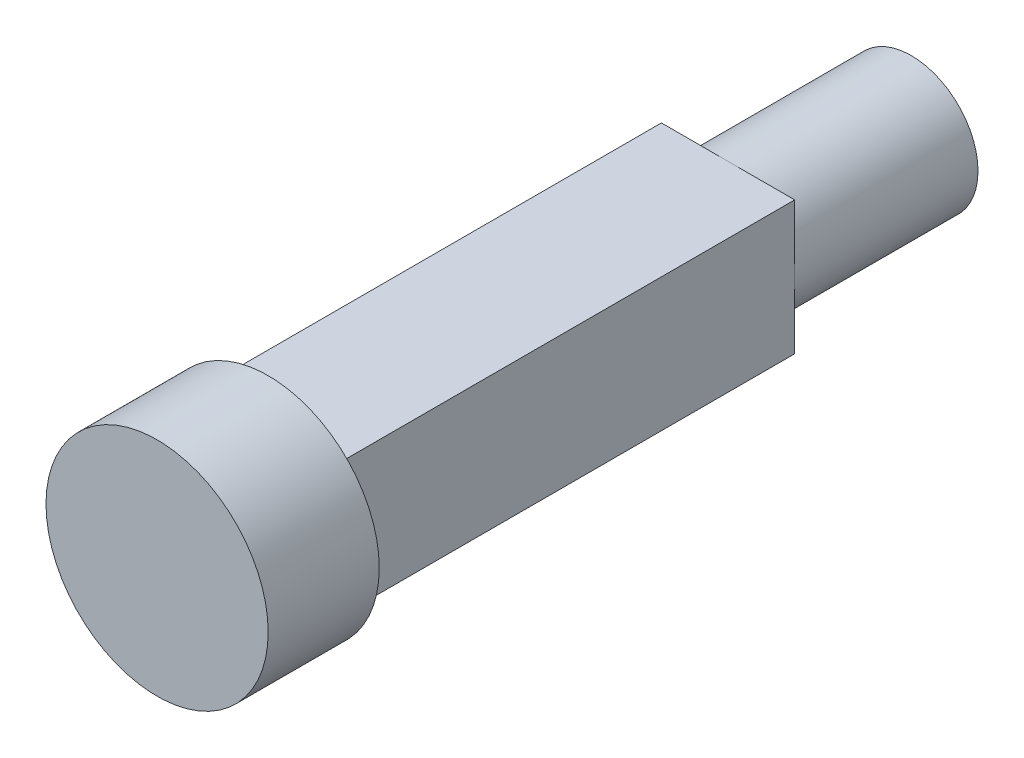
ISO-10303-21;
HEADER;
FILE_DESCRIPTION(('STEP AP214'),'2;1');
FILE_NAME('part.step','',(''),(''),'','','');
FILE_SCHEMA(('AUTOMOTIVE_DESIGN { 1 0 10303 214 1 1 1 1 }'));
ENDSEC;
DATA;
#1=APPLICATION_CONTEXT('core data for automotive mechanical design processes');
#2=APPLICATION_PROTOCOL_DEFINITION('international standard','automotive_design',2000,#1);
#3=PRODUCT_CONTEXT('',#1,'mechanical');
#4=PRODUCT('Part','Part','',(#3));
#5=PRODUCT_RELATED_PRODUCT_CATEGORY('part','',(#4));
#6=PRODUCT_DEFINITION_FORMATION('','',#4);
#7=PRODUCT_DEFINITION_CONTEXT('part definition',#1,'design');
#8=PRODUCT_DEFINITION('design','',#6,#7);
#9=PRODUCT_DEFINITION_SHAPE('','',#8);
#10=(LENGTH_UNIT() NAMED_UNIT(*) SI_UNIT(.MILLI.,.METRE.));
#11=(NAMED_UNIT(*) PLANE_ANGLE_UNIT() SI_UNIT($,.RADIAN.));
#12=(NAMED_UNIT(*) SI_UNIT($,.STERADIAN.) SOLID_ANGLE_UNIT());
#13=UNCERTAINTY_MEASURE_WITH_UNIT(LENGTH_MEASURE(1.E-05),#10,'distance_accuracy_value','');
#14=(GEOMETRIC_REPRESENTATION_CONTEXT(3) GLOBAL_UNCERTAINTY_ASSIGNED_CONTEXT((#13)) GLOBAL_UNIT_ASSIGNED_CONTEXT((#10,
#11,#12)) REPRESENTATION_CONTEXT('',''));
#15=CARTESIAN_POINT('',(0.,0.,0.));
#16=DIRECTION('',(0.,0.,1.));
#17=DIRECTION('',(1.,0.,0.));
#18=AXIS2_PLACEMENT_3D('',#15,#16,#17);
#19=CARTESIAN_POINT('',(0.,3.,-5.));
#20=DIRECTION('',(0.,0.,1.));
#21=DIRECTION('',(1.,0.,0.));
#22=AXIS2_PLACEMENT_3D('',#19,#20,#21);
#23=PLANE('',#22);
#24=CARTESIAN_POINT('',(0.,0.,-5.));
#25=DIRECTION('',(0.,0.,1.));
#26=DIRECTION('',(1.,0.,0.));
#27=AXIS2_PLACEMENT_3D('',#24,#25,#26);
#28=CIRCLE('',#27,5.);
#29=CARTESIAN_POINT('',(5.,0.,-5.));
#30=VERTEX_POINT('',#29);
#31=EDGE_CURVE('E170',#30,#30,#28,.T.);
#32=ORIENTED_EDGE('',*,*,#31,.F.);
#33=EDGE_LOOP('',(#32));
#34=FACE_BOUND('',#33,.T.);
#35=DIRECTION('',(0.,1.,0.));
#36=VECTOR('',#35,1.);
#37=CARTESIAN_POINT('',(-3.,3.,-5.));
#38=LINE('',#37,#36);
#39=CARTESIAN_POINT('',(-3.,-3.,-5.));
#40=VERTEX_POINT('',#39);
#41=CARTESIAN_POINT('',(-3.,3.,-5.));
#42=VERTEX_POINT('',#41);
#43=EDGE_CURVE('E189',#40,#42,#38,.T.);
#44=ORIENTED_EDGE('',*,*,#43,.F.);
#45=DIRECTION('',(-1.,0.,0.));
#46=VECTOR('',#45,1.);
#47=CARTESIAN_POINT('',(0.,-3.,-5.));
#48=LINE('',#47,#46);
#49=CARTESIAN_POINT('',(3.,-3.,-5.));
#50=VERTEX_POINT('',#49);
#51=EDGE_CURVE('E178',#50,#40,#48,.T.);
#52=ORIENTED_EDGE('',*,*,#51,.F.);
#53=DIRECTION('',(0.,-1.,0.));
#54=VECTOR('',#53,1.);
#55=CARTESIAN_POINT('',(3.,3.,-5.));
#56=LINE('',#55,#54);
#57=CARTESIAN_POINT('',(3.,3.,-5.));
#58=VERTEX_POINT('',#57);
#59=EDGE_CURVE('E182',#58,#50,#56,.T.);
#60=ORIENTED_EDGE('',*,*,#59,.F.);
#61=DIRECTION('',(1.,0.,0.));
#62=VECTOR('',#61,1.);
#63=CARTESIAN_POINT('',(0.,3.,-5.));
#64=LINE('',#63,#62);
#65=EDGE_CURVE('E186',#42,#58,#64,.T.);
#66=ORIENTED_EDGE('',*,*,#65,.F.);
#67=EDGE_LOOP('',(#44,#52,#60,#66));
#68=FACE_BOUND('',#67,.T.);
#69=ADVANCED_FACE('F39',(#34,#68),#23,.F.);
#70=CARTESIAN_POINT('',(0.,4.99999999999999,0.));
#71=DIRECTION('',(0.,0.,-1.));
#72=DIRECTION('',(-1.,0.,0.));
#73=AXIS2_PLACEMENT_3D('',#70,#71,#72);
#74=PLANE('',#73);
#75=CARTESIAN_POINT('',(0.,0.,0.));
#76=DIRECTION('',(0.,0.,1.));
#77=DIRECTION('',(1.,0.,0.));
#78=AXIS2_PLACEMENT_3D('',#75,#76,#77);
#79=CIRCLE('',#78,4.99999999999999);
#80=CARTESIAN_POINT('',(4.99999999999999,0.,0.));
#81=VERTEX_POINT('',#80);
#82=EDGE_CURVE('E166',#81,#81,#79,.T.);
#83=ORIENTED_EDGE('',*,*,#82,.T.);
#84=EDGE_LOOP('',(#83));
#85=FACE_BOUND('',#84,.T.);
#86=ADVANCED_FACE('F41',(#85),#74,.F.);
#87=CARTESIAN_POINT('',(0.,0.,0.));
#88=DIRECTION('',(0.,0.,1.));
#89=DIRECTION('',(1.,0.,0.));
#90=AXIS2_PLACEMENT_3D('',#87,#88,#89);
#91=CYLINDRICAL_SURFACE('',#90,5.);
#92=ORIENTED_EDGE('',*,*,#82,.F.);
#93=EDGE_LOOP('',(#92));
#94=FACE_BOUND('',#93,.T.);
#95=ORIENTED_EDGE('',*,*,#31,.T.);
#96=EDGE_LOOP('',(#95));
#97=FACE_BOUND('',#96,.T.);
#98=ADVANCED_FACE('F248',(#94,#97),#91,.T.);
#99=CARTESIAN_POINT('',(0.,0.,-25.7));
#100=DIRECTION('',(0.,0.,1.));
#101=DIRECTION('',(1.,0.,0.));
#102=AXIS2_PLACEMENT_3D('',#99,#100,#101);
#103=PLANE('',#102);
#104=DIRECTION('',(0.,-1.,0.));
#105=VECTOR('',#104,1.);
#106=CARTESIAN_POINT('',(3.,-3.,-25.7));
#107=LINE('',#106,#105);
#108=CARTESIAN_POINT('',(3.,3.,-25.7));
#109=VERTEX_POINT('',#108);
#110=CARTESIAN_POINT('',(3.,0.,-25.7));
#111=VERTEX_POINT('',#110);
#112=EDGE_CURVE('E141',#109,#111,#107,.T.);
#113=ORIENTED_EDGE('',*,*,#112,.T.);
#114=CARTESIAN_POINT('',(0.,0.,-25.7));
#115=DIRECTION('',(0.,0.,1.));
#116=DIRECTION('',(1.,0.,0.));
#117=AXIS2_PLACEMENT_3D('',#114,#115,#116);
#118=CIRCLE('',#117,3.);
#119=CARTESIAN_POINT('',(0.,3.,-25.7));
#120=VERTEX_POINT('',#119);
#121=EDGE_CURVE('E11',#111,#120,#118,.T.);
#122=ORIENTED_EDGE('',*,*,#121,.T.);
#123=DIRECTION('',(1.,0.,0.));
#124=VECTOR('',#123,1.);
#125=CARTESIAN_POINT('',(3.,3.,-25.7));
#126=LINE('',#125,#124);
#127=EDGE_CURVE('E135',#120,#109,#126,.T.);
#128=ORIENTED_EDGE('',*,*,#127,.T.);
#129=EDGE_LOOP('',(#113,#122,#128));
#130=FACE_BOUND('',#129,.T.);
#131=ADVANCED_FACE('F230',(#130),#103,.F.);
#132=CARTESIAN_POINT('',(-3.,3.,-25.7));
#133=VERTEX_POINT('',#132);
#134=EDGE_CURVE('E136',#133,#120,#126,.T.);
#135=ORIENTED_EDGE('',*,*,#134,.T.);
#136=CARTESIAN_POINT('',(-3.,0.,-25.7));
#137=VERTEX_POINT('',#136);
#138=EDGE_CURVE('E49',#120,#137,#118,.T.);
#139=ORIENTED_EDGE('',*,*,#138,.T.);
#140=DIRECTION('',(0.,1.,0.));
#141=VECTOR('',#140,1.);
#142=CARTESIAN_POINT('',(-3.,-3.,-25.7));
#143=LINE('',#142,#141);
#144=EDGE_CURVE('E129',#137,#133,#143,.T.);
#145=ORIENTED_EDGE('',*,*,#144,.T.);
#146=EDGE_LOOP('',(#135,#139,#145));
#147=FACE_BOUND('',#146,.T.);
#148=ADVANCED_FACE('F206',(#147),#103,.F.);
#149=CARTESIAN_POINT('',(-3.,-3.,-25.7));
#150=VERTEX_POINT('',#149);
#151=EDGE_CURVE('E131',#150,#137,#143,.T.);
#152=ORIENTED_EDGE('',*,*,#151,.T.);
#153=CARTESIAN_POINT('',(0.,-3.,-25.7));
#154=VERTEX_POINT('',#153);
#155=EDGE_CURVE('E196',#137,#154,#118,.T.);
#156=ORIENTED_EDGE('',*,*,#155,.T.);
#157=DIRECTION('',(-1.,0.,0.));
#158=VECTOR('',#157,1.);
#159=CARTESIAN_POINT('',(3.,-3.,-25.7));
#160=LINE('',#159,#158);
#161=EDGE_CURVE('E145',#154,#150,#160,.T.);
#162=ORIENTED_EDGE('',*,*,#161,.T.);
#163=EDGE_LOOP('',(#152,#156,#162));
#164=FACE_BOUND('',#163,.T.);
#165=ADVANCED_FACE('F211',(#164),#103,.F.);
#166=CARTESIAN_POINT('',(-3.,-3.,-25.7));
#167=DIRECTION('',(1.,0.,0.));
#168=DIRECTION('',(0.,0.,-1.));
#169=AXIS2_PLACEMENT_3D('',#166,#167,#168);
#170=PLANE('',#169);
#171=ORIENTED_EDGE('',*,*,#144,.F.);
#172=ORIENTED_EDGE('',*,*,#151,.F.);
#173=DIRECTION('',(0.,0.,1.));
#174=VECTOR('',#173,1.);
#175=CARTESIAN_POINT('',(-3.,-3.,-25.7));
#176=LINE('',#175,#174);
#177=EDGE_CURVE('E150',#150,#40,#176,.T.);
#178=ORIENTED_EDGE('',*,*,#177,.T.);
#179=ORIENTED_EDGE('',*,*,#43,.T.);
#180=DIRECTION('',(0.,0.,1.));
#181=VECTOR('',#180,1.);
#182=CARTESIAN_POINT('',(-3.,3.,-25.7));
#183=LINE('',#182,#181);
#184=EDGE_CURVE('E162',#133,#42,#183,.T.);
#185=ORIENTED_EDGE('',*,*,#184,.F.);
#186=EDGE_LOOP('',(#171,#172,#178,#179,#185));
#187=FACE_BOUND('',#186,.T.);
#188=ADVANCED_FACE('F209',(#187),#170,.F.);
#189=CARTESIAN_POINT('',(3.,3.,-25.7));
#190=DIRECTION('',(0.,-1.,0.));
#191=DIRECTION('',(0.,0.,-1.));
#192=AXIS2_PLACEMENT_3D('',#189,#190,#191);
#193=PLANE('',#192);
#194=ORIENTED_EDGE('',*,*,#127,.F.);
#195=ORIENTED_EDGE('',*,*,#134,.F.);
#196=ORIENTED_EDGE('',*,*,#184,.T.);
#197=ORIENTED_EDGE('',*,*,#65,.T.);
#198=DIRECTION('',(0.,0.,1.));
#199=VECTOR('',#198,1.);
#200=CARTESIAN_POINT('',(3.,3.,-25.7));
#201=LINE('',#200,#199);
#202=EDGE_CURVE('E158',#109,#58,#201,.T.);
#203=ORIENTED_EDGE('',*,*,#202,.F.);
#204=EDGE_LOOP('',(#194,#195,#196,#197,#203));
#205=FACE_BOUND('',#204,.T.);
#206=ADVANCED_FACE('F225',(#205),#193,.F.);
#207=CARTESIAN_POINT('',(3.,-3.,-25.7));
#208=DIRECTION('',(-1.,0.,0.));
#209=DIRECTION('',(0.,0.,1.));
#210=AXIS2_PLACEMENT_3D('',#207,#208,#209);
#211=PLANE('',#210);
#212=CARTESIAN_POINT('',(3.,-3.,-25.7));
#213=VERTEX_POINT('',#212);
#214=EDGE_CURVE('E140',#111,#213,#107,.T.);
#215=ORIENTED_EDGE('',*,*,#214,.F.);
#216=ORIENTED_EDGE('',*,*,#112,.F.);
#217=ORIENTED_EDGE('',*,*,#202,.T.);
#218=ORIENTED_EDGE('',*,*,#59,.T.);
#219=DIRECTION('',(0.,0.,1.));
#220=VECTOR('',#219,1.);
#221=CARTESIAN_POINT('',(3.,-3.,-25.7));
#222=LINE('',#221,#220);
#223=EDGE_CURVE('E154',#213,#50,#222,.T.);
#224=ORIENTED_EDGE('',*,*,#223,.F.);
#225=EDGE_LOOP('',(#215,#216,#217,#218,#224));
#226=FACE_BOUND('',#225,.T.);
#227=ADVANCED_FACE('F220',(#226),#211,.F.);
#228=CARTESIAN_POINT('',(3.,-3.,-25.7));
#229=DIRECTION('',(0.,1.,0.));
#230=DIRECTION('',(0.,0.,1.));
#231=AXIS2_PLACEMENT_3D('',#228,#229,#230);
#232=PLANE('',#231);
#233=ORIENTED_EDGE('',*,*,#161,.F.);
#234=EDGE_CURVE('E146',#213,#154,#160,.T.);
#235=ORIENTED_EDGE('',*,*,#234,.F.);
#236=ORIENTED_EDGE('',*,*,#223,.T.);
#237=ORIENTED_EDGE('',*,*,#51,.T.);
#238=ORIENTED_EDGE('',*,*,#177,.F.);
#239=EDGE_LOOP('',(#233,#235,#236,#237,#238));
#240=FACE_BOUND('',#239,.T.);
#241=ADVANCED_FACE('F216',(#240),#232,.F.);
#242=ORIENTED_EDGE('',*,*,#234,.T.);
#243=EDGE_CURVE('E43',#154,#111,#118,.T.);
#244=ORIENTED_EDGE('',*,*,#243,.T.);
#245=ORIENTED_EDGE('',*,*,#214,.T.);
#246=EDGE_LOOP('',(#242,#244,#245));
#247=FACE_BOUND('',#246,.T.);
#248=ADVANCED_FACE('F229',(#247),#103,.F.);
#249=CARTESIAN_POINT('',(0.,0.,-33.95));
#250=DIRECTION('',(0.,0.,1.));
#251=DIRECTION('',(1.,0.,0.));
#252=AXIS2_PLACEMENT_3D('',#249,#250,#251);
#253=PLANE('',#252);
#254=DIRECTION('',(1.,0.,0.));
#255=VECTOR('',#254,1.);
#256=CARTESIAN_POINT('',(1.20415945787923,1.2,-33.95));
#257=LINE('',#256,#255);
#258=CARTESIAN_POINT('',(-1.20415945787923,1.2,-33.95));
#259=VERTEX_POINT('',#258);
#260=CARTESIAN_POINT('',(1.20415945787923,1.2,-33.95));
#261=VERTEX_POINT('',#260);
#262=EDGE_CURVE('E118',#259,#261,#257,.T.);
#263=ORIENTED_EDGE('',*,*,#262,.F.);
#264=CARTESIAN_POINT('',(0.,0.,-33.95));
#265=DIRECTION('',(0.,0.,-1.));
#266=DIRECTION('',(-1.,0.,0.));
#267=AXIS2_PLACEMENT_3D('',#264,#265,#266);
#268=CIRCLE('',#267,1.7);
#269=EDGE_CURVE('E56',#261,#259,#268,.T.);
#270=ORIENTED_EDGE('',*,*,#269,.F.);
#271=EDGE_LOOP('',(#263,#270));
#272=FACE_BOUND('',#271,.T.);
#273=CARTESIAN_POINT('',(0.,0.,-33.95));
#274=DIRECTION('',(0.,0.,1.));
#275=DIRECTION('',(1.,0.,0.));
#276=AXIS2_PLACEMENT_3D('',#273,#274,#275);
#277=CIRCLE('',#276,3.);
#278=CARTESIAN_POINT('',(3.,0.,-33.95));
#279=VERTEX_POINT('',#278);
#280=EDGE_CURVE('E174',#279,#279,#277,.T.);
#281=ORIENTED_EDGE('',*,*,#280,.F.);
#282=EDGE_LOOP('',(#281));
#283=FACE_BOUND('',#282,.T.);
#284=ADVANCED_FACE('F233',(#272,#283),#253,.F.);
#285=CARTESIAN_POINT('',(0.,0.,0.));
#286=DIRECTION('',(0.,0.,1.));
#287=DIRECTION('',(1.,0.,0.));
#288=AXIS2_PLACEMENT_3D('',#285,#286,#287);
#289=CYLINDRICAL_SURFACE('',#288,3.);
#290=ORIENTED_EDGE('',*,*,#280,.T.);
#291=EDGE_LOOP('',(#290));
#292=FACE_BOUND('',#291,.T.);
#293=ORIENTED_EDGE('',*,*,#121,.F.);
#294=ORIENTED_EDGE('',*,*,#243,.F.);
#295=ORIENTED_EDGE('',*,*,#155,.F.);
#296=ORIENTED_EDGE('',*,*,#138,.F.);
#297=EDGE_LOOP('',(#293,#294,#295,#296));
#298=FACE_BOUND('',#297,.T.);
#299=ADVANCED_FACE('F231',(#292,#298),#289,.T.);
#300=CARTESIAN_POINT('',(0.,0.,-23.95));
#301=DIRECTION('',(0.,0.,-1.));
#302=DIRECTION('',(-1.,0.,0.));
#303=AXIS2_PLACEMENT_3D('',#300,#301,#302);
#304=CYLINDRICAL_SURFACE('',#303,1.7);
#305=ORIENTED_EDGE('',*,*,#269,.T.);
#306=DIRECTION('',(0.,0.,-1.));
#307=VECTOR('',#306,1.);
#308=CARTESIAN_POINT('',(-1.20415945787923,1.2,-23.95));
#309=LINE('',#308,#307);
#310=CARTESIAN_POINT('',(-1.20415945787923,1.2,-23.95));
#311=VERTEX_POINT('',#310);
#312=EDGE_CURVE('E102',#311,#259,#309,.T.);
#313=ORIENTED_EDGE('',*,*,#312,.F.);
#314=CARTESIAN_POINT('',(0.,0.,-23.95));
#315=DIRECTION('',(0.,0.,-1.));
#316=DIRECTION('',(-1.,0.,0.));
#317=AXIS2_PLACEMENT_3D('',#314,#315,#316);
#318=CIRCLE('',#317,1.7);
#319=CARTESIAN_POINT('',(1.20415945787923,1.2,-23.95));
#320=VERTEX_POINT('',#319);
#321=EDGE_CURVE('E105',#320,#311,#318,.T.);
#322=ORIENTED_EDGE('',*,*,#321,.F.);
#323=DIRECTION('',(0.,0.,-1.));
#324=VECTOR('',#323,1.);
#325=CARTESIAN_POINT('',(1.20415945787923,1.2,-23.95));
#326=LINE('',#325,#324);
#327=EDGE_CURVE('E112',#320,#261,#326,.T.);
#328=ORIENTED_EDGE('',*,*,#327,.T.);
#329=EDGE_LOOP('',(#305,#313,#322,#328));
#330=FACE_BOUND('',#329,.T.);
#331=ADVANCED_FACE('F104',(#330),#304,.F.);
#332=CARTESIAN_POINT('',(1.20415945787923,1.2,-23.95));
#333=DIRECTION('',(0.,1.,0.));
#334=DIRECTION('',(0.,0.,1.));
#335=AXIS2_PLACEMENT_3D('',#332,#333,#334);
#336=PLANE('',#335);
#337=ORIENTED_EDGE('',*,*,#262,.T.);
#338=ORIENTED_EDGE('',*,*,#327,.F.);
#339=DIRECTION('',(1.,0.,0.));
#340=VECTOR('',#339,1.);
#341=CARTESIAN_POINT('',(1.20415945787923,1.2,-23.95));
#342=LINE('',#341,#340);
#343=EDGE_CURVE('E113',#311,#320,#342,.T.);
#344=ORIENTED_EDGE('',*,*,#343,.F.);
#345=ORIENTED_EDGE('',*,*,#312,.T.);
#346=EDGE_LOOP('',(#337,#338,#344,#345));
#347=FACE_BOUND('',#346,.T.);
#348=ADVANCED_FACE('F120',(#347),#336,.F.);
#349=CARTESIAN_POINT('',(0.,0.,-23.95));
#350=DIRECTION('',(0.,0.,-1.));
#351=DIRECTION('',(-1.,0.,0.));
#352=AXIS2_PLACEMENT_3D('',#349,#350,#351);
#353=PLANE('',#352);
#354=ORIENTED_EDGE('',*,*,#321,.T.);
#355=ORIENTED_EDGE('',*,*,#343,.T.);
#356=EDGE_LOOP('',(#354,#355));
#357=FACE_BOUND('',#356,.T.);
#358=ADVANCED_FACE('F116',(#357),#353,.T.);
#359=CLOSED_SHELL('',(#69,#86,#98,#131,#148,#165,#188,#206,#227,#241,#248,#284,#299,#331,#348,#358));
#360=MANIFOLD_SOLID_BREP('B2',#359);
#361=ADVANCED_BREP_SHAPE_REPRESENTATION('',(#18,#360),#14);
#362=SHAPE_DEFINITION_REPRESENTATION(#9,#361);
ENDSEC;
END-ISO-10303-21;
